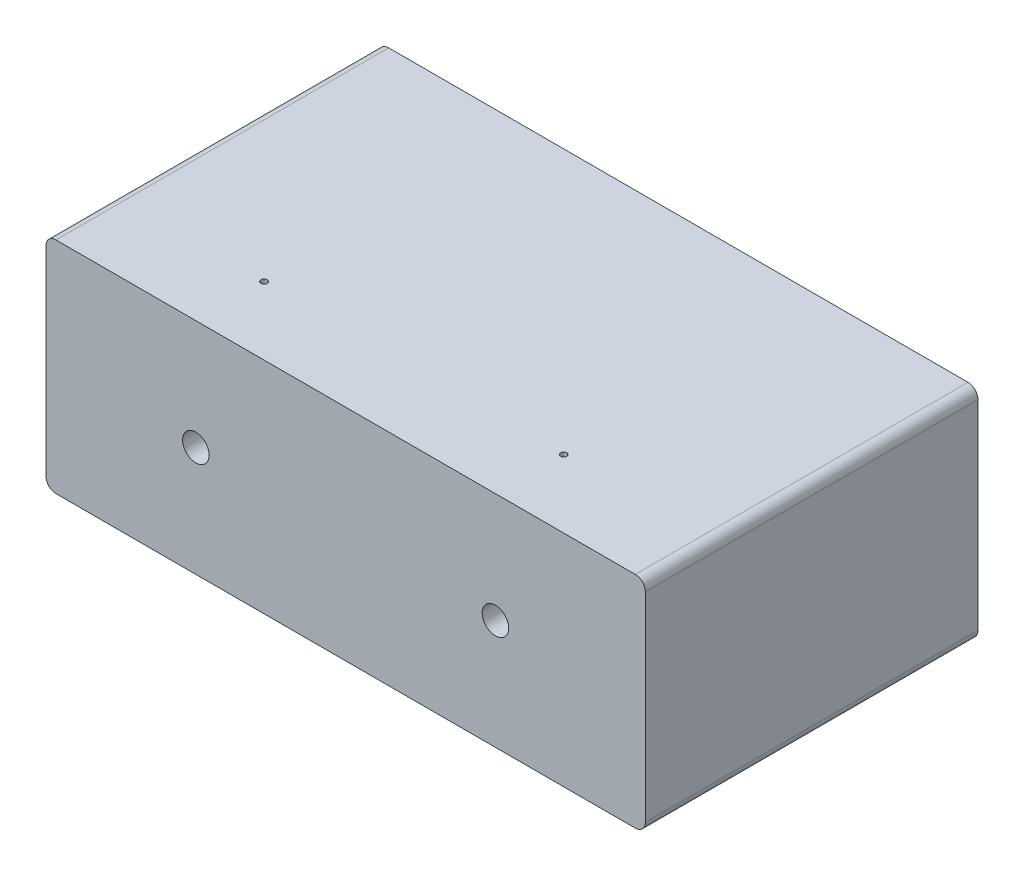
ISO-10303-21;
HEADER;
FILE_DESCRIPTION(('STEP AP214'),'2;1');
FILE_NAME('part.step','',(''),(''),'','','');
FILE_SCHEMA(('AUTOMOTIVE_DESIGN { 1 0 10303 214 1 1 1 1 }'));
ENDSEC;
DATA;
#1=APPLICATION_CONTEXT('core data for automotive mechanical design processes');
#2=APPLICATION_PROTOCOL_DEFINITION('international standard','automotive_design',2000,#1);
#3=PRODUCT_CONTEXT('',#1,'mechanical');
#4=PRODUCT('Part','Part','',(#3));
#5=PRODUCT_RELATED_PRODUCT_CATEGORY('part','',(#4));
#6=PRODUCT_DEFINITION_FORMATION('','',#4);
#7=PRODUCT_DEFINITION_CONTEXT('part definition',#1,'design');
#8=PRODUCT_DEFINITION('design','',#6,#7);
#9=PRODUCT_DEFINITION_SHAPE('','',#8);
#10=(LENGTH_UNIT() NAMED_UNIT(*) SI_UNIT(.MILLI.,.METRE.));
#11=(NAMED_UNIT(*) PLANE_ANGLE_UNIT() SI_UNIT($,.RADIAN.));
#12=(NAMED_UNIT(*) SI_UNIT($,.STERADIAN.) SOLID_ANGLE_UNIT());
#13=UNCERTAINTY_MEASURE_WITH_UNIT(LENGTH_MEASURE(1.E-05),#10,'distance_accuracy_value','');
#14=(GEOMETRIC_REPRESENTATION_CONTEXT(3) GLOBAL_UNCERTAINTY_ASSIGNED_CONTEXT((#13)) GLOBAL_UNIT_ASSIGNED_CONTEXT((#10,
#11,#12)) REPRESENTATION_CONTEXT('',''));
#15=CARTESIAN_POINT('',(0.,0.,0.));
#16=DIRECTION('',(0.,0.,1.));
#17=DIRECTION('',(1.,0.,0.));
#18=AXIS2_PLACEMENT_3D('',#15,#16,#17);
#19=CARTESIAN_POINT('',(-76.2,55.88,42.3037));
#20=DIRECTION('',(1.,0.,0.));
#21=DIRECTION('',(0.,0.,-1.));
#22=AXIS2_PLACEMENT_3D('',#19,#20,#21);
#23=PLANE('',#22);
#24=DIRECTION('',(0.,-1.,0.));
#25=VECTOR('',#24,1.);
#26=CARTESIAN_POINT('',(-76.2,55.88,-42.3037));
#27=LINE('',#26,#25);
#28=CARTESIAN_POINT('',(-76.2,53.34,-42.3037));
#29=VERTEX_POINT('',#28);
#30=CARTESIAN_POINT('',(-76.2,2.54,-42.3037));
#31=VERTEX_POINT('',#30);
#32=EDGE_CURVE('E142',#29,#31,#27,.T.);
#33=ORIENTED_EDGE('',*,*,#32,.T.);
#34=DIRECTION('',(0.,0.,1.));
#35=VECTOR('',#34,1.);
#36=CARTESIAN_POINT('',(-76.2,2.54,42.3037));
#37=LINE('',#36,#35);
#38=CARTESIAN_POINT('',(-76.2,2.54,42.3037));
#39=VERTEX_POINT('',#38);
#40=EDGE_CURVE('E159',#31,#39,#37,.T.);
#41=ORIENTED_EDGE('',*,*,#40,.T.);
#42=DIRECTION('',(0.,-1.,0.));
#43=VECTOR('',#42,1.);
#44=CARTESIAN_POINT('',(-76.2,55.88,42.3037));
#45=LINE('',#44,#43);
#46=CARTESIAN_POINT('',(-76.2,53.34,42.3037));
#47=VERTEX_POINT('',#46);
#48=EDGE_CURVE('E154',#47,#39,#45,.T.);
#49=ORIENTED_EDGE('',*,*,#48,.F.);
#50=DIRECTION('',(0.,0.,1.));
#51=VECTOR('',#50,1.);
#52=CARTESIAN_POINT('',(-76.2,53.34,-42.3037));
#53=LINE('',#52,#51);
#54=EDGE_CURVE('E157',#47,#29,#53,.F.);
#55=ORIENTED_EDGE('',*,*,#54,.T.);
#56=EDGE_LOOP('',(#33,#41,#49,#55));
#57=FACE_BOUND('',#56,.T.);
#58=ADVANCED_FACE('F34',(#57),#23,.F.);
#59=CARTESIAN_POINT('',(76.2,55.88,42.3037));
#60=DIRECTION('',(0.,0.,-1.));
#61=DIRECTION('',(-1.,0.,0.));
#62=AXIS2_PLACEMENT_3D('',#59,#60,#61);
#63=PLANE('',#62);
#64=CARTESIAN_POINT('',(-38.1,27.94,42.3037));
#65=DIRECTION('',(0.,0.,1.));
#66=DIRECTION('',(1.,0.,0.));
#67=AXIS2_PLACEMENT_3D('',#64,#65,#66);
#68=CIRCLE('',#67,3.3782);
#69=CARTESIAN_POINT('',(-34.7218,27.94,42.3037));
#70=VERTEX_POINT('',#69);
#71=EDGE_CURVE('E122',#70,#70,#68,.T.);
#72=ORIENTED_EDGE('',*,*,#71,.F.);
#73=EDGE_LOOP('',(#72));
#74=FACE_BOUND('',#73,.T.);
#75=CARTESIAN_POINT('',(38.1,27.94,42.3037));
#76=DIRECTION('',(0.,0.,1.));
#77=DIRECTION('',(1.,0.,0.));
#78=AXIS2_PLACEMENT_3D('',#75,#76,#77);
#79=CIRCLE('',#78,3.3782);
#80=CARTESIAN_POINT('',(41.4782,27.94,42.3037));
#81=VERTEX_POINT('',#80);
#82=EDGE_CURVE('E121',#81,#81,#79,.T.);
#83=ORIENTED_EDGE('',*,*,#82,.F.);
#84=EDGE_LOOP('',(#83));
#85=FACE_BOUND('',#84,.T.);
#86=ORIENTED_EDGE('',*,*,#48,.T.);
#87=CARTESIAN_POINT('',(-73.66,2.54,42.3037));
#88=DIRECTION('',(0.,0.,-1.));
#89=DIRECTION('',(-1.,0.,0.));
#90=AXIS2_PLACEMENT_3D('',#87,#88,#89);
#91=CIRCLE('',#90,2.54);
#92=CARTESIAN_POINT('',(-73.66,0.,42.3037));
#93=VERTEX_POINT('',#92);
#94=EDGE_CURVE('E168',#39,#93,#91,.F.);
#95=ORIENTED_EDGE('',*,*,#94,.T.);
#96=DIRECTION('',(1.,0.,0.));
#97=VECTOR('',#96,1.);
#98=CARTESIAN_POINT('',(76.2,0.,42.3037));
#99=LINE('',#98,#97);
#100=CARTESIAN_POINT('',(73.66,0.,42.3037));
#101=VERTEX_POINT('',#100);
#102=EDGE_CURVE('E134',#93,#101,#99,.T.);
#103=ORIENTED_EDGE('',*,*,#102,.T.);
#104=CARTESIAN_POINT('',(73.66,2.54,42.3037));
#105=DIRECTION('',(0.,0.,-1.));
#106=DIRECTION('',(-1.,0.,0.));
#107=AXIS2_PLACEMENT_3D('',#104,#105,#106);
#108=CIRCLE('',#107,2.54);
#109=CARTESIAN_POINT('',(76.2,2.54,42.3037));
#110=VERTEX_POINT('',#109);
#111=EDGE_CURVE('E166',#101,#110,#108,.F.);
#112=ORIENTED_EDGE('',*,*,#111,.T.);
#113=DIRECTION('',(0.,-1.,0.));
#114=VECTOR('',#113,1.);
#115=CARTESIAN_POINT('',(76.2,55.88,42.3037));
#116=LINE('',#115,#114);
#117=CARTESIAN_POINT('',(76.2,53.34,42.3037));
#118=VERTEX_POINT('',#117);
#119=EDGE_CURVE('E151',#118,#110,#116,.T.);
#120=ORIENTED_EDGE('',*,*,#119,.F.);
#121=CARTESIAN_POINT('',(73.66,53.34,42.3037));
#122=DIRECTION('',(0.,0.,-1.));
#123=DIRECTION('',(-1.,0.,0.));
#124=AXIS2_PLACEMENT_3D('',#121,#122,#123);
#125=CIRCLE('',#124,2.54);
#126=CARTESIAN_POINT('',(73.66,55.88,42.3037));
#127=VERTEX_POINT('',#126);
#128=EDGE_CURVE('E164',#118,#127,#125,.F.);
#129=ORIENTED_EDGE('',*,*,#128,.T.);
#130=DIRECTION('',(1.,0.,0.));
#131=VECTOR('',#130,1.);
#132=CARTESIAN_POINT('',(76.2,55.88,42.3037));
#133=LINE('',#132,#131);
#134=CARTESIAN_POINT('',(-73.66,55.88,42.3037));
#135=VERTEX_POINT('',#134);
#136=EDGE_CURVE('E135',#135,#127,#133,.T.);
#137=ORIENTED_EDGE('',*,*,#136,.F.);
#138=CARTESIAN_POINT('',(-73.66,53.34,42.3037));
#139=DIRECTION('',(0.,0.,-1.));
#140=DIRECTION('',(-1.,0.,0.));
#141=AXIS2_PLACEMENT_3D('',#138,#139,#140);
#142=CIRCLE('',#141,2.54);
#143=EDGE_CURVE('E162',#135,#47,#142,.F.);
#144=ORIENTED_EDGE('',*,*,#143,.T.);
#145=EDGE_LOOP('',(#86,#95,#103,#112,#120,#129,#137,#144));
#146=FACE_BOUND('',#145,.T.);
#147=ADVANCED_FACE('F205',(#74,#85,#146),#63,.F.);
#148=CARTESIAN_POINT('',(76.2,55.88,42.3037));
#149=DIRECTION('',(-1.,0.,0.));
#150=DIRECTION('',(0.,0.,1.));
#151=AXIS2_PLACEMENT_3D('',#148,#149,#150);
#152=PLANE('',#151);
#153=ORIENTED_EDGE('',*,*,#119,.T.);
#154=DIRECTION('',(0.,0.,-1.));
#155=VECTOR('',#154,1.);
#156=CARTESIAN_POINT('',(76.2,2.54,42.3037));
#157=LINE('',#156,#155);
#158=CARTESIAN_POINT('',(76.2,2.54,-42.3037));
#159=VERTEX_POINT('',#158);
#160=EDGE_CURVE('E182',#110,#159,#157,.T.);
#161=ORIENTED_EDGE('',*,*,#160,.T.);
#162=DIRECTION('',(0.,-1.,0.));
#163=VECTOR('',#162,1.);
#164=CARTESIAN_POINT('',(76.2,55.88,-42.3037));
#165=LINE('',#164,#163);
#166=CARTESIAN_POINT('',(76.2,53.34,-42.3037));
#167=VERTEX_POINT('',#166);
#168=EDGE_CURVE('E149',#167,#159,#165,.T.);
#169=ORIENTED_EDGE('',*,*,#168,.F.);
#170=DIRECTION('',(0.,0.,-1.));
#171=VECTOR('',#170,1.);
#172=CARTESIAN_POINT('',(76.2,53.34,42.3037));
#173=LINE('',#172,#171);
#174=EDGE_CURVE('E180',#167,#118,#173,.F.);
#175=ORIENTED_EDGE('',*,*,#174,.T.);
#176=EDGE_LOOP('',(#153,#161,#169,#175));
#177=FACE_BOUND('',#176,.T.);
#178=ADVANCED_FACE('F211',(#177),#152,.F.);
#179=CARTESIAN_POINT('',(76.2,55.88,-42.3037));
#180=DIRECTION('',(0.,0.,1.));
#181=DIRECTION('',(1.,0.,0.));
#182=AXIS2_PLACEMENT_3D('',#179,#180,#181);
#183=PLANE('',#182);
#184=DIRECTION('',(-1.,0.,0.));
#185=VECTOR('',#184,1.);
#186=CARTESIAN_POINT('',(76.2,0.,-42.3037));
#187=LINE('',#186,#185);
#188=CARTESIAN_POINT('',(73.66,0.,-42.3037));
#189=VERTEX_POINT('',#188);
#190=CARTESIAN_POINT('',(-73.66,0.,-42.3037));
#191=VERTEX_POINT('',#190);
#192=EDGE_CURVE('E139',#189,#191,#187,.T.);
#193=ORIENTED_EDGE('',*,*,#192,.T.);
#194=CARTESIAN_POINT('',(-73.66,2.54,-42.3037));
#195=DIRECTION('',(0.,0.,1.));
#196=DIRECTION('',(1.,0.,0.));
#197=AXIS2_PLACEMENT_3D('',#194,#195,#196);
#198=CIRCLE('',#197,2.54);
#199=EDGE_CURVE('E178',#191,#31,#198,.F.);
#200=ORIENTED_EDGE('',*,*,#199,.T.);
#201=ORIENTED_EDGE('',*,*,#32,.F.);
#202=CARTESIAN_POINT('',(-73.66,53.34,-42.3037));
#203=DIRECTION('',(0.,0.,1.));
#204=DIRECTION('',(1.,0.,0.));
#205=AXIS2_PLACEMENT_3D('',#202,#203,#204);
#206=CIRCLE('',#205,2.54);
#207=CARTESIAN_POINT('',(-73.66,55.88,-42.3037));
#208=VERTEX_POINT('',#207);
#209=EDGE_CURVE('E174',#29,#208,#206,.F.);
#210=ORIENTED_EDGE('',*,*,#209,.T.);
#211=DIRECTION('',(-1.,0.,0.));
#212=VECTOR('',#211,1.);
#213=CARTESIAN_POINT('',(76.2,55.88,-42.3037));
#214=LINE('',#213,#212);
#215=CARTESIAN_POINT('',(73.66,55.88,-42.3037));
#216=VERTEX_POINT('',#215);
#217=EDGE_CURVE('E138',#216,#208,#214,.T.);
#218=ORIENTED_EDGE('',*,*,#217,.F.);
#219=CARTESIAN_POINT('',(73.66,53.34,-42.3037));
#220=DIRECTION('',(0.,0.,1.));
#221=DIRECTION('',(1.,0.,0.));
#222=AXIS2_PLACEMENT_3D('',#219,#220,#221);
#223=CIRCLE('',#222,2.54);
#224=EDGE_CURVE('E63',#216,#167,#223,.F.);
#225=ORIENTED_EDGE('',*,*,#224,.T.);
#226=ORIENTED_EDGE('',*,*,#168,.T.);
#227=CARTESIAN_POINT('',(73.66,2.54,-42.3037));
#228=DIRECTION('',(0.,0.,1.));
#229=DIRECTION('',(1.,0.,0.));
#230=AXIS2_PLACEMENT_3D('',#227,#228,#229);
#231=CIRCLE('',#230,2.54);
#232=EDGE_CURVE('E55',#159,#189,#231,.F.);
#233=ORIENTED_EDGE('',*,*,#232,.T.);
#234=EDGE_LOOP('',(#193,#200,#201,#210,#218,#225,#226,#233));
#235=FACE_BOUND('',#234,.T.);
#236=ADVANCED_FACE('F252',(#235),#183,.F.);
#237=CARTESIAN_POINT('',(-76.2,55.88,-42.3037));
#238=DIRECTION('',(0.,1.,0.));
#239=DIRECTION('',(0.,0.,1.));
#240=AXIS2_PLACEMENT_3D('',#237,#238,#239);
#241=PLANE('',#240);
#242=CARTESIAN_POINT('',(38.1609879394625,55.88,25.0113757542834));
#243=DIRECTION('',(0.,1.,0.));
#244=DIRECTION('',(0.,0.,1.));
#245=AXIS2_PLACEMENT_3D('',#242,#243,#244);
#246=CIRCLE('',#245,0.793749999999996);
#247=CARTESIAN_POINT('',(38.1609879394625,55.88,25.8051257542834));
#248=VERTEX_POINT('',#247);
#249=EDGE_CURVE('E279',#248,#248,#246,.T.);
#250=ORIENTED_EDGE('',*,*,#249,.F.);
#251=EDGE_LOOP('',(#250));
#252=FACE_BOUND('',#251,.T.);
#253=CARTESIAN_POINT('',(-38.0390120605375,55.88,25.0113757542834));
#254=DIRECTION('',(0.,1.,0.));
#255=DIRECTION('',(0.,0.,1.));
#256=AXIS2_PLACEMENT_3D('',#253,#254,#255);
#257=CIRCLE('',#256,0.793749999999996);
#258=CARTESIAN_POINT('',(-38.0390120605375,55.88,25.8051257542834));
#259=VERTEX_POINT('',#258);
#260=EDGE_CURVE('E190',#259,#259,#257,.T.);
#261=ORIENTED_EDGE('',*,*,#260,.F.);
#262=EDGE_LOOP('',(#261));
#263=FACE_BOUND('',#262,.T.);
#264=ORIENTED_EDGE('',*,*,#136,.T.);
#265=DIRECTION('',(0.,0.,-1.));
#266=VECTOR('',#265,1.);
#267=CARTESIAN_POINT('',(73.66,55.88,-42.3037));
#268=LINE('',#267,#266);
#269=EDGE_CURVE('E11',#127,#216,#268,.T.);
#270=ORIENTED_EDGE('',*,*,#269,.T.);
#271=ORIENTED_EDGE('',*,*,#217,.T.);
#272=DIRECTION('',(0.,0.,1.));
#273=VECTOR('',#272,1.);
#274=CARTESIAN_POINT('',(-73.66,55.88,42.3037));
#275=LINE('',#274,#273);
#276=EDGE_CURVE('E47',#208,#135,#275,.T.);
#277=ORIENTED_EDGE('',*,*,#276,.T.);
#278=EDGE_LOOP('',(#264,#270,#271,#277));
#279=FACE_BOUND('',#278,.T.);
#280=ADVANCED_FACE('F238',(#252,#263,#279),#241,.T.);
#281=CARTESIAN_POINT('',(-76.2,0.,-42.3037));
#282=DIRECTION('',(0.,1.,0.));
#283=DIRECTION('',(0.,0.,1.));
#284=AXIS2_PLACEMENT_3D('',#281,#282,#283);
#285=PLANE('',#284);
#286=ORIENTED_EDGE('',*,*,#102,.F.);
#287=DIRECTION('',(0.,0.,1.));
#288=VECTOR('',#287,1.);
#289=CARTESIAN_POINT('',(-73.66,0.,-42.3037));
#290=LINE('',#289,#288);
#291=EDGE_CURVE('E172',#93,#191,#290,.F.);
#292=ORIENTED_EDGE('',*,*,#291,.T.);
#293=ORIENTED_EDGE('',*,*,#192,.F.);
#294=DIRECTION('',(0.,0.,-1.));
#295=VECTOR('',#294,1.);
#296=CARTESIAN_POINT('',(73.66,0.,-42.3037));
#297=LINE('',#296,#295);
#298=EDGE_CURVE('E170',#189,#101,#297,.F.);
#299=ORIENTED_EDGE('',*,*,#298,.T.);
#300=EDGE_LOOP('',(#286,#292,#293,#299));
#301=FACE_BOUND('',#300,.T.);
#302=ADVANCED_FACE('F220',(#301),#285,.F.);
#303=CARTESIAN_POINT('',(-73.66,2.54,42.3037));
#304=DIRECTION('',(0.,0.,1.));
#305=DIRECTION('',(1.,0.,0.));
#306=AXIS2_PLACEMENT_3D('',#303,#304,#305);
#307=CYLINDRICAL_SURFACE('',#306,2.54);
#308=ORIENTED_EDGE('',*,*,#199,.F.);
#309=ORIENTED_EDGE('',*,*,#291,.F.);
#310=ORIENTED_EDGE('',*,*,#94,.F.);
#311=ORIENTED_EDGE('',*,*,#40,.F.);
#312=EDGE_LOOP('',(#308,#309,#310,#311));
#313=FACE_BOUND('',#312,.T.);
#314=ADVANCED_FACE('F216',(#313),#307,.T.);
#315=CARTESIAN_POINT('',(73.66,2.54,42.3037));
#316=DIRECTION('',(0.,0.,-1.));
#317=DIRECTION('',(-1.,0.,0.));
#318=AXIS2_PLACEMENT_3D('',#315,#316,#317);
#319=CYLINDRICAL_SURFACE('',#318,2.54);
#320=ORIENTED_EDGE('',*,*,#111,.F.);
#321=ORIENTED_EDGE('',*,*,#298,.F.);
#322=ORIENTED_EDGE('',*,*,#232,.F.);
#323=ORIENTED_EDGE('',*,*,#160,.F.);
#324=EDGE_LOOP('',(#320,#321,#322,#323));
#325=FACE_BOUND('',#324,.T.);
#326=ADVANCED_FACE('F219',(#325),#319,.T.);
#327=CARTESIAN_POINT('',(73.66,53.34,-42.3037));
#328=DIRECTION('',(0.,0.,1.));
#329=DIRECTION('',(1.,0.,0.));
#330=AXIS2_PLACEMENT_3D('',#327,#328,#329);
#331=CYLINDRICAL_SURFACE('',#330,2.54);
#332=ORIENTED_EDGE('',*,*,#128,.F.);
#333=ORIENTED_EDGE('',*,*,#174,.F.);
#334=ORIENTED_EDGE('',*,*,#224,.F.);
#335=ORIENTED_EDGE('',*,*,#269,.F.);
#336=EDGE_LOOP('',(#332,#333,#334,#335));
#337=FACE_BOUND('',#336,.T.);
#338=ADVANCED_FACE('F223',(#337),#331,.T.);
#339=CARTESIAN_POINT('',(-73.66,53.34,-42.3037));
#340=DIRECTION('',(0.,0.,-1.));
#341=DIRECTION('',(-1.,0.,0.));
#342=AXIS2_PLACEMENT_3D('',#339,#340,#341);
#343=CYLINDRICAL_SURFACE('',#342,2.54);
#344=ORIENTED_EDGE('',*,*,#209,.F.);
#345=ORIENTED_EDGE('',*,*,#54,.F.);
#346=ORIENTED_EDGE('',*,*,#143,.F.);
#347=ORIENTED_EDGE('',*,*,#276,.F.);
#348=EDGE_LOOP('',(#344,#345,#346,#347));
#349=FACE_BOUND('',#348,.T.);
#350=ADVANCED_FACE('F36',(#349),#343,.T.);
#351=CARTESIAN_POINT('',(38.1,27.94,22.6187));
#352=DIRECTION('',(0.,0.,1.));
#353=DIRECTION('',(1.,0.,0.));
#354=AXIS2_PLACEMENT_3D('',#351,#352,#353);
#355=CONICAL_SURFACE('',#354,3.3782,1.02974425867665);
#356=CARTESIAN_POINT('',(38.1,27.94,20.5888726568011));
#357=VERTEX_POINT('',#356);
#358=VERTEX_LOOP('',#357);
#359=FACE_BOUND('',#358,.T.);
#360=CARTESIAN_POINT('',(38.1,27.94,22.6187));
#361=DIRECTION('',(0.,0.,1.));
#362=DIRECTION('',(1.,0.,0.));
#363=AXIS2_PLACEMENT_3D('',#360,#361,#362);
#364=CIRCLE('',#363,3.3782);
#365=CARTESIAN_POINT('',(41.4782,27.94,22.6187));
#366=VERTEX_POINT('',#365);
#367=EDGE_CURVE('E125',#366,#366,#364,.T.);
#368=ORIENTED_EDGE('',*,*,#367,.T.);
#369=EDGE_LOOP('',(#368));
#370=FACE_BOUND('',#369,.T.);
#371=ADVANCED_FACE('F229',(#359,#370),#355,.F.);
#372=CARTESIAN_POINT('',(38.1,27.94,42.3037));
#373=DIRECTION('',(0.,0.,1.));
#374=DIRECTION('',(1.,0.,0.));
#375=AXIS2_PLACEMENT_3D('',#372,#373,#374);
#376=CYLINDRICAL_SURFACE('',#375,3.3782);
#377=CARTESIAN_POINT('',(38.1609879394625,31.3176494358118,25.8051257542834));
#378=CARTESIAN_POINT('',(38.2050435259454,31.3168531266894,25.805124326073));
#379=CARTESIAN_POINT('',(38.2491000935285,31.3151874934955,25.8014454574515));
#380=CARTESIAN_POINT('',(38.3359239872223,31.3102329843534,25.7868608718324));
#381=CARTESIAN_POINT('',(38.3786904074702,31.3069429947913,25.775950195147));
#382=CARTESIAN_POINT('',(38.4616688560844,31.2990425072797,25.7472795437936));
#383=CARTESIAN_POINT('',(38.5018839806238,31.2944336488263,25.7295280635418));
#384=CARTESIAN_POINT('',(38.5787536895852,31.2843287931373,25.6877084884917));
#385=CARTESIAN_POINT('',(38.6154082678186,31.2788327943599,25.6636403827148));
#386=CARTESIAN_POINT('',(38.6848548202734,31.2673777146581,25.6093555038215));
#387=CARTESIAN_POINT('',(38.7175650036203,31.2614120591461,25.5790354576951));
#388=CARTESIAN_POINT('',(38.77747900887,31.2497116741839,25.5133269165881));
#389=CARTESIAN_POINT('',(38.8046822809269,31.243976967839,25.4779379160919));
#390=CARTESIAN_POINT('',(38.8531047813047,31.2332798840412,25.4025810322518));
#391=CARTESIAN_POINT('',(38.8742519220278,31.2283271021193,25.3625653580727));
#392=CARTESIAN_POINT('',(38.9094814079675,31.2198331960258,25.2793964577019));
#393=CARTESIAN_POINT('',(38.9235649745888,31.2162918278201,25.2362437754276));
#394=CARTESIAN_POINT('',(38.9439620867378,31.211096542158,25.1490388301046));
#395=CARTESIAN_POINT('',(38.9504406248282,31.2094026044699,25.1050275843559));
#396=CARTESIAN_POINT('',(38.9559584941123,31.2079625388154,25.0165128239573));
#397=CARTESIAN_POINT('',(38.9549990272615,31.2082160961406,24.9720093900039));
#398=CARTESIAN_POINT('',(38.9457915595745,31.2106104361127,24.8849064357275));
#399=CARTESIAN_POINT('',(38.9377195601586,31.212705643618,24.8422868722735));
#400=CARTESIAN_POINT('',(38.9147945385347,31.2184879970301,24.7590277989322));
#401=CARTESIAN_POINT('',(38.8999410482487,31.2221752528236,24.7183884259379));
#402=CARTESIAN_POINT('',(38.8637175987416,31.2307930716878,24.6397524785776));
#403=CARTESIAN_POINT('',(38.8422811479574,31.2357362277627,24.601787968664));
#404=CARTESIAN_POINT('',(38.7935522764294,31.2463333975521,24.5299334615775));
#405=CARTESIAN_POINT('',(38.7662588330709,31.2519875353305,24.496044177542));
#406=CARTESIAN_POINT('',(38.7056511660829,31.2636124057937,24.4322625630947));
#407=CARTESIAN_POINT('',(38.6721844606055,31.2695875622693,24.4025157669363));
#408=CARTESIAN_POINT('',(38.6006805068944,31.2810871953291,24.3490291528977));
#409=CARTESIAN_POINT('',(38.5626430393644,31.2866116502682,24.3252896234043));
#410=CARTESIAN_POINT('',(38.4827708736418,31.2966872619585,24.2843823670969));
#411=CARTESIAN_POINT('',(38.4409150880428,31.3012324815157,24.2672542563144));
#412=CARTESIAN_POINT('',(38.3547828755777,31.3088555489117,24.2403260946722));
#413=CARTESIAN_POINT('',(38.3105068631835,31.3119336471278,24.2305247932647));
#414=CARTESIAN_POINT('',(38.2218926509864,31.316284829781,24.2187340252747));
#415=CARTESIAN_POINT('',(38.1775799226591,31.3175982886369,24.2165679141377));
#416=CARTESIAN_POINT('',(38.0891974568447,31.3184717037243,24.2196435300932));
#417=CARTESIAN_POINT('',(38.0451276955885,31.3180318346434,24.2248845191682));
#418=CARTESIAN_POINT('',(37.9592309778942,31.3155350652964,24.2424647706484));
#419=CARTESIAN_POINT('',(37.9173791676927,31.3135046495075,24.2546868941614));
#420=CARTESIAN_POINT('',(37.8363079442259,31.3081380113348,24.285767705094));
#421=CARTESIAN_POINT('',(37.7970887308072,31.3048016899477,24.3046268956723));
#422=CARTESIAN_POINT('',(37.7218348994755,31.297182854445,24.3487219511829));
#423=CARTESIAN_POINT('',(37.6858477016767,31.2928887281218,24.3740366733428));
#424=CARTESIAN_POINT('',(37.6185654611871,31.2838914816639,24.4302229932188));
#425=CARTESIAN_POINT('',(37.5872710866161,31.2791883034425,24.4610953808086));
#426=CARTESIAN_POINT('',(37.5295851884257,31.269825197984,24.5282908361505));
#427=CARTESIAN_POINT('',(37.5033107602331,31.2651682660932,24.5647149769683));
#428=CARTESIAN_POINT('',(37.4572407265947,31.2565715921432,24.6415318625263));
#429=CARTESIAN_POINT('',(37.4374449521692,31.2526318313796,24.6819245037222));
#430=CARTESIAN_POINT('',(37.4049758578266,31.245972227951,24.7654375124013));
#431=CARTESIAN_POINT('',(37.3922814876224,31.2432487847175,24.8085493920628));
#432=CARTESIAN_POINT('',(37.3743379530502,31.2393538187067,24.8963615901202));
#433=CARTESIAN_POINT('',(37.3690875923003,31.2381820465509,24.9410616520837));
#434=CARTESIAN_POINT('',(37.3662379395963,31.2375491243112,25.0297490649329));
#435=CARTESIAN_POINT('',(37.368476167135,31.238051645942,25.0737310096665));
#436=CARTESIAN_POINT('',(37.3801724674945,31.2406239923895,25.1606750106874));
#437=CARTESIAN_POINT('',(37.3896304535962,31.2426937983811,25.2036370792185));
#438=CARTESIAN_POINT('',(37.4154128380122,31.2481334386771,25.2871654983884));
#439=CARTESIAN_POINT('',(37.4317093840246,31.251497995121,25.3277408140133));
#440=CARTESIAN_POINT('',(37.4706861336481,31.259125170848,25.4056075198068));
#441=CARTESIAN_POINT('',(37.4933670369366,31.26338788855,25.442898549454));
#442=CARTESIAN_POINT('',(37.5450095410686,31.2724044895725,25.5139460200977));
#443=CARTESIAN_POINT('',(37.5740882316362,31.2771665237975,25.547616339586));
#444=CARTESIAN_POINT('',(37.6374717951511,31.2865395872234,25.6096539592122));
#445=CARTESIAN_POINT('',(37.6717777679218,31.2911505843973,25.6380201405524));
#446=CARTESIAN_POINT('',(37.7451298807076,31.2997142984526,25.6889583488409));
#447=CARTESIAN_POINT('',(37.7842265345797,31.3036587308483,25.7114591107585));
#448=CARTESIAN_POINT('',(37.8657324186294,31.3103145255294,25.7495376849148));
#449=CARTESIAN_POINT('',(37.9081389706726,31.3130268728554,25.7651210273393));
#450=CARTESIAN_POINT('',(37.9856285428057,31.3164359813932,25.7863186209326));
#451=CARTESIAN_POINT('',(38.0203149934419,31.3174415567304,25.7933591194467));
#452=CARTESIAN_POINT('',(38.0903300859977,31.3183675478997,25.8027631474607));
#453=CARTESIAN_POINT('',(38.125658697266,31.3182880153905,25.8051268995999));
#454=CARTESIAN_POINT('',(38.1609879394625,31.3176494358118,25.8051257542834));
#455=B_SPLINE_CURVE_WITH_KNOTS('',3,(#377,#378,#379,#380,#381,#382,#383,#384,#385,#386,#387,
#388,#389,#390,#391,#392,#393,#394,#395,#396,#397,#398,#399,#400,#401,#402,#403,#404,#405,#406,
#407,#408,#409,#410,#411,#412,#413,#414,#415,#416,#417,#418,#419,#420,#421,#422,#423,#424,#425,
#426,#427,#428,#429,#430,#431,#432,#433,#434,#435,#436,#437,#438,#439,#440,#441,#442,#443,#444,
#445,#446,#447,#448,#449,#450,#451,#452,#453,#454),.UNSPECIFIED.,.T.,.F.,(4,2,2,2,2,2,2,2,2,2,2,
2,2,2,2,2,2,2,2,2,2,2,2,2,2,2,2,2,2,2,2,2,2,2,2,2,2,2,4),(0.,0.132058323864931,
0.264207309246007,0.396192727561567,0.528178375273617,0.662549639397327,0.79693431341229,
0.932857770865203,1.06875771687224,1.20165135249037,1.33452351341183,1.46419725073853,
1.59387993987539,1.72491815792714,1.85597927353178,1.9908657912534,2.12575878315422,
2.26144795913941,2.39711397025813,2.52961988867709,2.66211260560222,2.79244487908755,
2.92278703524149,3.05480477474932,3.18684129188902,3.32165768286619,3.4564705572096,
3.59088166672479,3.72527117158691,3.85676389018902,3.98825502940884,4.11921574693762,
4.25019082236518,4.38379876552208,4.51743485878749,4.65262601552323,4.78770889710766,
4.89361470840766,4.99951547787555),.UNSPECIFIED.);
#456=CARTESIAN_POINT('',(38.1609879394625,31.3176494358118,25.8051257542834));
#457=VERTEX_POINT('',#456);
#458=EDGE_CURVE('E38',#457,#457,#455,.T.);
#459=ORIENTED_EDGE('',*,*,#458,.T.);
#460=EDGE_LOOP('',(#459));
#461=FACE_BOUND('',#460,.T.);
#462=ORIENTED_EDGE('',*,*,#367,.F.);
#463=EDGE_LOOP('',(#462));
#464=FACE_BOUND('',#463,.T.);
#465=ORIENTED_EDGE('',*,*,#82,.T.);
#466=EDGE_LOOP('',(#465));
#467=FACE_BOUND('',#466,.T.);
#468=ADVANCED_FACE('F115',(#461,#464,#467),#376,.F.);
#469=CARTESIAN_POINT('',(-38.1,27.94,22.6187));
#470=DIRECTION('',(0.,0.,1.));
#471=DIRECTION('',(1.,0.,0.));
#472=AXIS2_PLACEMENT_3D('',#469,#470,#471);
#473=CONICAL_SURFACE('',#472,3.3782,1.02974425867665);
#474=CARTESIAN_POINT('',(-38.1,27.94,20.5888726568011));
#475=VERTEX_POINT('',#474);
#476=VERTEX_LOOP('',#475);
#477=FACE_BOUND('',#476,.T.);
#478=CARTESIAN_POINT('',(-38.1,27.94,22.6187));
#479=DIRECTION('',(0.,0.,1.));
#480=DIRECTION('',(1.,0.,0.));
#481=AXIS2_PLACEMENT_3D('',#478,#479,#480);
#482=CIRCLE('',#481,3.3782);
#483=CARTESIAN_POINT('',(-34.7218,27.94,22.6187));
#484=VERTEX_POINT('',#483);
#485=EDGE_CURVE('E119',#484,#484,#482,.T.);
#486=ORIENTED_EDGE('',*,*,#485,.T.);
#487=EDGE_LOOP('',(#486));
#488=FACE_BOUND('',#487,.T.);
#489=ADVANCED_FACE('F111',(#477,#488),#473,.F.);
#490=CARTESIAN_POINT('',(-38.1,27.94,42.3037));
#491=DIRECTION('',(0.,0.,1.));
#492=DIRECTION('',(1.,0.,0.));
#493=AXIS2_PLACEMENT_3D('',#490,#491,#492);
#494=CYLINDRICAL_SURFACE('',#493,3.3782);
#495=CARTESIAN_POINT('',(-38.0390120605375,31.3176494358118,25.8051257542834));
#496=CARTESIAN_POINT('',(-37.9949564740546,31.3168531266894,25.805124326073));
#497=CARTESIAN_POINT('',(-37.9508999064715,31.3151874934955,25.8014454574515));
#498=CARTESIAN_POINT('',(-37.8640760127777,31.3102329843534,25.7868608718324));
#499=CARTESIAN_POINT('',(-37.8213095925298,31.3069429947913,25.775950195147));
#500=CARTESIAN_POINT('',(-37.7383311439156,31.2990425072797,25.7472795437936));
#501=CARTESIAN_POINT('',(-37.6981160193762,31.2944336488263,25.7295280635418));
#502=CARTESIAN_POINT('',(-37.6212463104148,31.2843287931373,25.6877084884917));
#503=CARTESIAN_POINT('',(-37.5845917321814,31.2788327943599,25.6636403827148));
#504=CARTESIAN_POINT('',(-37.5151451797266,31.2673777146581,25.6093555038215));
#505=CARTESIAN_POINT('',(-37.4824349963797,31.2614120591461,25.5790354576951));
#506=CARTESIAN_POINT('',(-37.42252099113,31.2497116741839,25.5133269165881));
#507=CARTESIAN_POINT('',(-37.3953177190731,31.243976967839,25.4779379160919));
#508=CARTESIAN_POINT('',(-37.3468952186953,31.2332798840412,25.4025810322518));
#509=CARTESIAN_POINT('',(-37.3257480779722,31.2283271021193,25.3625653580727));
#510=CARTESIAN_POINT('',(-37.2905185920325,31.2198331960258,25.2793964577019));
#511=CARTESIAN_POINT('',(-37.2764350254112,31.2162918278201,25.2362437754276));
#512=CARTESIAN_POINT('',(-37.2560379132622,31.211096542158,25.1490388301046));
#513=CARTESIAN_POINT('',(-37.2495593751718,31.2094026044699,25.1050275843559));
#514=CARTESIAN_POINT('',(-37.2440415058877,31.2079625388154,25.0165128239573));
#515=CARTESIAN_POINT('',(-37.2450009727385,31.2082160961406,24.9720093900039));
#516=CARTESIAN_POINT('',(-37.2542084404256,31.2106104361127,24.8849064357275));
#517=CARTESIAN_POINT('',(-37.2622804398414,31.212705643618,24.8422868722735));
#518=CARTESIAN_POINT('',(-37.2852054614653,31.2184879970301,24.7590277989322));
#519=CARTESIAN_POINT('',(-37.3000589517513,31.2221752528236,24.7183884259379));
#520=CARTESIAN_POINT('',(-37.3362824012584,31.2307930716878,24.6397524785776));
#521=CARTESIAN_POINT('',(-37.3577188520426,31.2357362277627,24.601787968664));
#522=CARTESIAN_POINT('',(-37.4064477235706,31.2463333975521,24.5299334615775));
#523=CARTESIAN_POINT('',(-37.4337411669291,31.2519875353305,24.496044177542));
#524=CARTESIAN_POINT('',(-37.4943488339171,31.2636124057937,24.4322625630947));
#525=CARTESIAN_POINT('',(-37.5278155393945,31.2695875622693,24.4025157669363));
#526=CARTESIAN_POINT('',(-37.5993194931056,31.2810871953291,24.3490291528977));
#527=CARTESIAN_POINT('',(-37.6373569606356,31.2866116502682,24.3252896234043));
#528=CARTESIAN_POINT('',(-37.7172291263582,31.2966872619585,24.2843823670969));
#529=CARTESIAN_POINT('',(-37.7590849119572,31.3012324815157,24.2672542563144));
#530=CARTESIAN_POINT('',(-37.8452171244223,31.3088555489117,24.2403260946722));
#531=CARTESIAN_POINT('',(-37.8894931368165,31.3119336471278,24.2305247932647));
#532=CARTESIAN_POINT('',(-37.9781073490137,31.316284829781,24.2187340252747));
#533=CARTESIAN_POINT('',(-38.022420077341,31.3175982886369,24.2165679141377));
#534=CARTESIAN_POINT('',(-38.1108025431553,31.3184717037243,24.2196435300932));
#535=CARTESIAN_POINT('',(-38.1548723044115,31.3180318346434,24.2248845191682));
#536=CARTESIAN_POINT('',(-38.2407690221058,31.3155350652965,24.2424647706484));
#537=CARTESIAN_POINT('',(-38.2826208323073,31.3135046495075,24.2546868941614));
#538=CARTESIAN_POINT('',(-38.3636920557741,31.3081380113348,24.285767705094));
#539=CARTESIAN_POINT('',(-38.4029112691928,31.3048016899477,24.3046268956723));
#540=CARTESIAN_POINT('',(-38.4781651005245,31.297182854445,24.3487219511829));
#541=CARTESIAN_POINT('',(-38.5141522983233,31.2928887281218,24.3740366733428));
#542=CARTESIAN_POINT('',(-38.5814345388129,31.2838914816639,24.4302229932188));
#543=CARTESIAN_POINT('',(-38.6127289133839,31.2791883034425,24.4610953808086));
#544=CARTESIAN_POINT('',(-38.6704148115743,31.269825197984,24.5282908361505));
#545=CARTESIAN_POINT('',(-38.6966892397669,31.2651682660932,24.5647149769683));
#546=CARTESIAN_POINT('',(-38.7427592734053,31.2565715921432,24.6415318625263));
#547=CARTESIAN_POINT('',(-38.7625550478308,31.2526318313796,24.6819245037222));
#548=CARTESIAN_POINT('',(-38.7950241421734,31.245972227951,24.7654375124013));
#549=CARTESIAN_POINT('',(-38.8077185123776,31.2432487847175,24.8085493920628));
#550=CARTESIAN_POINT('',(-38.8256620469498,31.2393538187067,24.8963615901202));
#551=CARTESIAN_POINT('',(-38.8309124076997,31.2381820465509,24.9410616520837));
#552=CARTESIAN_POINT('',(-38.8337620604037,31.2375491243112,25.0297490649329));
#553=CARTESIAN_POINT('',(-38.831523832865,31.238051645942,25.0737310096665));
#554=CARTESIAN_POINT('',(-38.8198275325055,31.2406239923895,25.1606750106874));
#555=CARTESIAN_POINT('',(-38.8103695464038,31.2426937983811,25.2036370792185));
#556=CARTESIAN_POINT('',(-38.7845871619878,31.2481334386771,25.2871654983884));
#557=CARTESIAN_POINT('',(-38.7682906159754,31.251497995121,25.3277408140133));
#558=CARTESIAN_POINT('',(-38.7293138663519,31.259125170848,25.4056075198068));
#559=CARTESIAN_POINT('',(-38.7066329630634,31.26338788855,25.442898549454));
#560=CARTESIAN_POINT('',(-38.6549904589314,31.2724044895725,25.5139460200977));
#561=CARTESIAN_POINT('',(-38.6259117683638,31.2771665237975,25.547616339586));
#562=CARTESIAN_POINT('',(-38.5625282048489,31.2865395872234,25.6096539592122));
#563=CARTESIAN_POINT('',(-38.5282222320782,31.2911505843973,25.6380201405524));
#564=CARTESIAN_POINT('',(-38.4548701192924,31.2997142984526,25.6889583488409));
#565=CARTESIAN_POINT('',(-38.4157734654203,31.3036587308483,25.7114591107585));
#566=CARTESIAN_POINT('',(-38.3342675813706,31.3103145255294,25.7495376849148));
#567=CARTESIAN_POINT('',(-38.2918610293274,31.3130268728554,25.7651210273393));
#568=CARTESIAN_POINT('',(-38.2143714571943,31.3164359813932,25.7863186209326));
#569=CARTESIAN_POINT('',(-38.1796850065581,31.3174415567304,25.7933591194467));
#570=CARTESIAN_POINT('',(-38.1096699140023,31.3183675478997,25.8027631474607));
#571=CARTESIAN_POINT('',(-38.074341302734,31.3182880153905,25.8051268995999));
#572=CARTESIAN_POINT('',(-38.0390120605375,31.3176494358118,25.8051257542834));
#573=B_SPLINE_CURVE_WITH_KNOTS('',3,(#495,#496,#497,#498,#499,#500,#501,#502,#503,#504,#505,
#506,#507,#508,#509,#510,#511,#512,#513,#514,#515,#516,#517,#518,#519,#520,#521,#522,#523,#524,
#525,#526,#527,#528,#529,#530,#531,#532,#533,#534,#535,#536,#537,#538,#539,#540,#541,#542,#543,
#544,#545,#546,#547,#548,#549,#550,#551,#552,#553,#554,#555,#556,#557,#558,#559,#560,#561,#562,
#563,#564,#565,#566,#567,#568,#569,#570,#571,#572),.UNSPECIFIED.,.T.,.F.,(4,2,2,2,2,2,2,2,2,2,2,
2,2,2,2,2,2,2,2,2,2,2,2,2,2,2,2,2,2,2,2,2,2,2,2,2,2,2,4),(0.,0.132058323864924,
0.264207309246007,0.396192727561567,0.528178375273617,0.662549639397327,0.79693431341229,
0.932857770865202,1.06875771687224,1.20165135249037,1.33452351341183,1.46419725073853,
1.59387993987539,1.72491815792714,1.85597927353178,1.9908657912534,2.12575878315422,
2.26144795913941,2.39711397025813,2.5296198886771,2.66211260560222,2.79244487908755,
2.92278703524148,3.05480477474932,3.18684129188902,3.32165768286619,3.4564705572096,
3.59088166672479,3.72527117158691,3.85676389018902,3.98825502940884,4.11921574693763,
4.25019082236518,4.38379876552208,4.51743485878749,4.65262601552326,4.78770889710766,
4.89361470840766,4.99951547787555),.UNSPECIFIED.);
#574=CARTESIAN_POINT('',(-38.0390120605375,31.3176494358118,25.8051257542834));
#575=VERTEX_POINT('',#574);
#576=EDGE_CURVE('E128',#575,#575,#573,.T.);
#577=ORIENTED_EDGE('',*,*,#576,.T.);
#578=EDGE_LOOP('',(#577));
#579=FACE_BOUND('',#578,.T.);
#580=ORIENTED_EDGE('',*,*,#485,.F.);
#581=EDGE_LOOP('',(#580));
#582=FACE_BOUND('',#581,.T.);
#583=ORIENTED_EDGE('',*,*,#71,.T.);
#584=EDGE_LOOP('',(#583));
#585=FACE_BOUND('',#584,.T.);
#586=ADVANCED_FACE('F114',(#579,#582,#585),#494,.F.);
#587=CARTESIAN_POINT('',(-38.0390120605375,55.88,25.0113757542834));
#588=DIRECTION('',(0.,1.,0.));
#589=DIRECTION('',(0.,0.,1.));
#590=AXIS2_PLACEMENT_3D('',#587,#588,#589);
#591=CYLINDRICAL_SURFACE('',#590,0.793749999999996);
#592=ORIENTED_EDGE('',*,*,#260,.T.);
#593=EDGE_LOOP('',(#592));
#594=FACE_BOUND('',#593,.T.);
#595=ORIENTED_EDGE('',*,*,#576,.F.);
#596=EDGE_LOOP('',(#595));
#597=FACE_BOUND('',#596,.T.);
#598=ADVANCED_FACE('F192',(#594,#597),#591,.F.);
#599=CARTESIAN_POINT('',(38.1609879394625,55.88,25.0113757542834));
#600=DIRECTION('',(0.,1.,0.));
#601=DIRECTION('',(0.,0.,1.));
#602=AXIS2_PLACEMENT_3D('',#599,#600,#601);
#603=CYLINDRICAL_SURFACE('',#602,0.793749999999996);
#604=ORIENTED_EDGE('',*,*,#249,.T.);
#605=EDGE_LOOP('',(#604));
#606=FACE_BOUND('',#605,.T.);
#607=ORIENTED_EDGE('',*,*,#458,.F.);
#608=EDGE_LOOP('',(#607));
#609=FACE_BOUND('',#608,.T.);
#610=ADVANCED_FACE('F195',(#606,#609),#603,.F.);
#611=CLOSED_SHELL('',(#58,#147,#178,#236,#280,#302,#314,#326,#338,#350,#371,#468,#489,#586,#598,#610));
#612=MANIFOLD_SOLID_BREP('B2',#611);
#613=ADVANCED_BREP_SHAPE_REPRESENTATION('',(#18,#612),#14);
#614=SHAPE_DEFINITION_REPRESENTATION(#9,#613);
ENDSEC;
END-ISO-10303-21;
